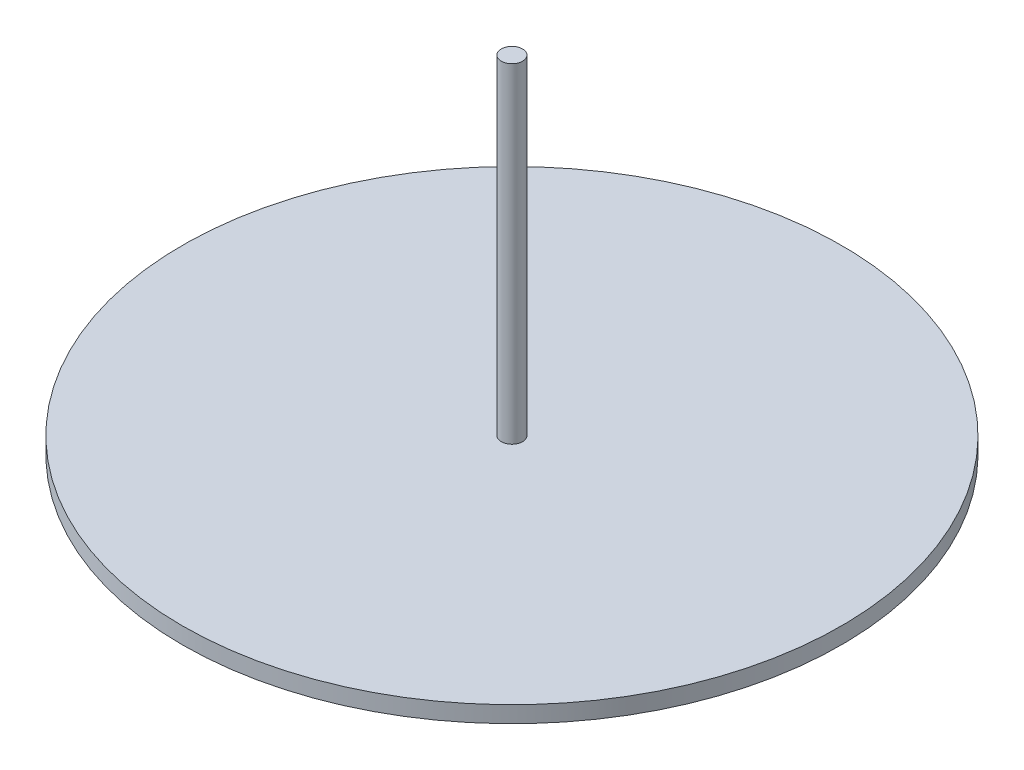
ISO-10303-21;
HEADER;
FILE_DESCRIPTION(('STEP AP214'),'2;1');
FILE_NAME('part.step','',(''),(''),'','','');
FILE_SCHEMA(('AUTOMOTIVE_DESIGN { 1 0 10303 214 1 1 1 1 }'));
ENDSEC;
DATA;
#1=APPLICATION_CONTEXT('core data for automotive mechanical design processes');
#2=APPLICATION_PROTOCOL_DEFINITION('international standard','automotive_design',2000,#1);
#3=PRODUCT_CONTEXT('',#1,'mechanical');
#4=PRODUCT('Part','Part','',(#3));
#5=PRODUCT_RELATED_PRODUCT_CATEGORY('part','',(#4));
#6=PRODUCT_DEFINITION_FORMATION('','',#4);
#7=PRODUCT_DEFINITION_CONTEXT('part definition',#1,'design');
#8=PRODUCT_DEFINITION('design','',#6,#7);
#9=PRODUCT_DEFINITION_SHAPE('','',#8);
#10=(LENGTH_UNIT() NAMED_UNIT(*) SI_UNIT(.MILLI.,.METRE.));
#11=(NAMED_UNIT(*) PLANE_ANGLE_UNIT() SI_UNIT($,.RADIAN.));
#12=(NAMED_UNIT(*) SI_UNIT($,.STERADIAN.) SOLID_ANGLE_UNIT());
#13=UNCERTAINTY_MEASURE_WITH_UNIT(LENGTH_MEASURE(1.E-05),#10,'distance_accuracy_value','');
#14=(GEOMETRIC_REPRESENTATION_CONTEXT(3) GLOBAL_UNCERTAINTY_ASSIGNED_CONTEXT((#13)) GLOBAL_UNIT_ASSIGNED_CONTEXT((#10,
#11,#12)) REPRESENTATION_CONTEXT('',''));
#15=CARTESIAN_POINT('',(0.,0.,0.));
#16=DIRECTION('',(0.,0.,1.));
#17=DIRECTION('',(1.,0.,0.));
#18=AXIS2_PLACEMENT_3D('',#15,#16,#17);
#19=CARTESIAN_POINT('',(0.,5.,0.));
#20=DIRECTION('',(0.,-1.,0.));
#21=DIRECTION('',(0.,0.,-1.));
#22=AXIS2_PLACEMENT_3D('',#19,#20,#21);
#23=CYLINDRICAL_SURFACE('',#22,100.);
#24=CARTESIAN_POINT('',(0.,5.,0.));
#25=DIRECTION('',(0.,1.,0.));
#26=DIRECTION('',(0.,0.,1.));
#27=AXIS2_PLACEMENT_3D('',#24,#25,#26);
#28=CIRCLE('',#27,100.);
#29=CARTESIAN_POINT('',(0.,5.,100.));
#30=VERTEX_POINT('',#29);
#31=EDGE_CURVE('E10',#30,#30,#28,.T.);
#32=ORIENTED_EDGE('',*,*,#31,.F.);
#33=EDGE_LOOP('',(#32));
#34=FACE_BOUND('',#33,.T.);
#35=CARTESIAN_POINT('',(0.,0.,0.));
#36=DIRECTION('',(0.,1.,0.));
#37=DIRECTION('',(0.,0.,1.));
#38=AXIS2_PLACEMENT_3D('',#35,#36,#37);
#39=CIRCLE('',#38,100.);
#40=CARTESIAN_POINT('',(0.,0.,100.));
#41=VERTEX_POINT('',#40);
#42=EDGE_CURVE('E46',#41,#41,#39,.T.);
#43=ORIENTED_EDGE('',*,*,#42,.T.);
#44=EDGE_LOOP('',(#43));
#45=FACE_BOUND('',#44,.T.);
#46=ADVANCED_FACE('F43',(#34,#45),#23,.T.);
#47=CARTESIAN_POINT('',(0.,5.,0.));
#48=DIRECTION('',(0.,1.,0.));
#49=DIRECTION('',(0.,0.,1.));
#50=AXIS2_PLACEMENT_3D('',#47,#48,#49);
#51=PLANE('',#50);
#52=CARTESIAN_POINT('',(0.,5.,0.));
#53=DIRECTION('',(0.,1.,0.));
#54=DIRECTION('',(0.,0.,1.));
#55=AXIS2_PLACEMENT_3D('',#52,#53,#54);
#56=CIRCLE('',#55,3.225);
#57=CARTESIAN_POINT('',(0.,5.,3.225));
#58=VERTEX_POINT('',#57);
#59=EDGE_CURVE('E57',#58,#58,#56,.T.);
#60=ORIENTED_EDGE('',*,*,#59,.F.);
#61=EDGE_LOOP('',(#60));
#62=FACE_BOUND('',#61,.T.);
#63=ORIENTED_EDGE('',*,*,#31,.T.);
#64=EDGE_LOOP('',(#63));
#65=FACE_BOUND('',#64,.T.);
#66=ADVANCED_FACE('F74',(#62,#65),#51,.T.);
#67=CARTESIAN_POINT('',(0.,0.,0.));
#68=DIRECTION('',(0.,1.,0.));
#69=DIRECTION('',(0.,0.,1.));
#70=AXIS2_PLACEMENT_3D('',#67,#68,#69);
#71=PLANE('',#70);
#72=ORIENTED_EDGE('',*,*,#42,.F.);
#73=EDGE_LOOP('',(#72));
#74=FACE_BOUND('',#73,.T.);
#75=ADVANCED_FACE('F70',(#74),#71,.F.);
#76=CARTESIAN_POINT('',(0.,105.,0.));
#77=DIRECTION('',(0.,-1.,0.));
#78=DIRECTION('',(0.,0.,-1.));
#79=AXIS2_PLACEMENT_3D('',#76,#77,#78);
#80=CYLINDRICAL_SURFACE('',#79,3.225);
#81=CARTESIAN_POINT('',(0.,105.,0.));
#82=DIRECTION('',(0.,1.,0.));
#83=DIRECTION('',(0.,0.,1.));
#84=AXIS2_PLACEMENT_3D('',#81,#82,#83);
#85=CIRCLE('',#84,3.225);
#86=CARTESIAN_POINT('',(0.,105.,3.225));
#87=VERTEX_POINT('',#86);
#88=EDGE_CURVE('E55',#87,#87,#85,.T.);
#89=ORIENTED_EDGE('',*,*,#88,.F.);
#90=EDGE_LOOP('',(#89));
#91=FACE_BOUND('',#90,.T.);
#92=ORIENTED_EDGE('',*,*,#59,.T.);
#93=EDGE_LOOP('',(#92));
#94=FACE_BOUND('',#93,.T.);
#95=ADVANCED_FACE('F67',(#91,#94),#80,.T.);
#96=CARTESIAN_POINT('',(0.,105.,0.));
#97=DIRECTION('',(0.,1.,0.));
#98=DIRECTION('',(0.,0.,1.));
#99=AXIS2_PLACEMENT_3D('',#96,#97,#98);
#100=PLANE('',#99);
#101=ORIENTED_EDGE('',*,*,#88,.T.);
#102=EDGE_LOOP('',(#101));
#103=FACE_BOUND('',#102,.T.);
#104=ADVANCED_FACE('F65',(#103),#100,.T.);
#105=CLOSED_SHELL('',(#46,#66,#75,#95,#104));
#106=MANIFOLD_SOLID_BREP('B2',#105);
#107=ADVANCED_BREP_SHAPE_REPRESENTATION('',(#18,#106),#14);
#108=SHAPE_DEFINITION_REPRESENTATION(#9,#107);
ENDSEC;
END-ISO-10303-21;
